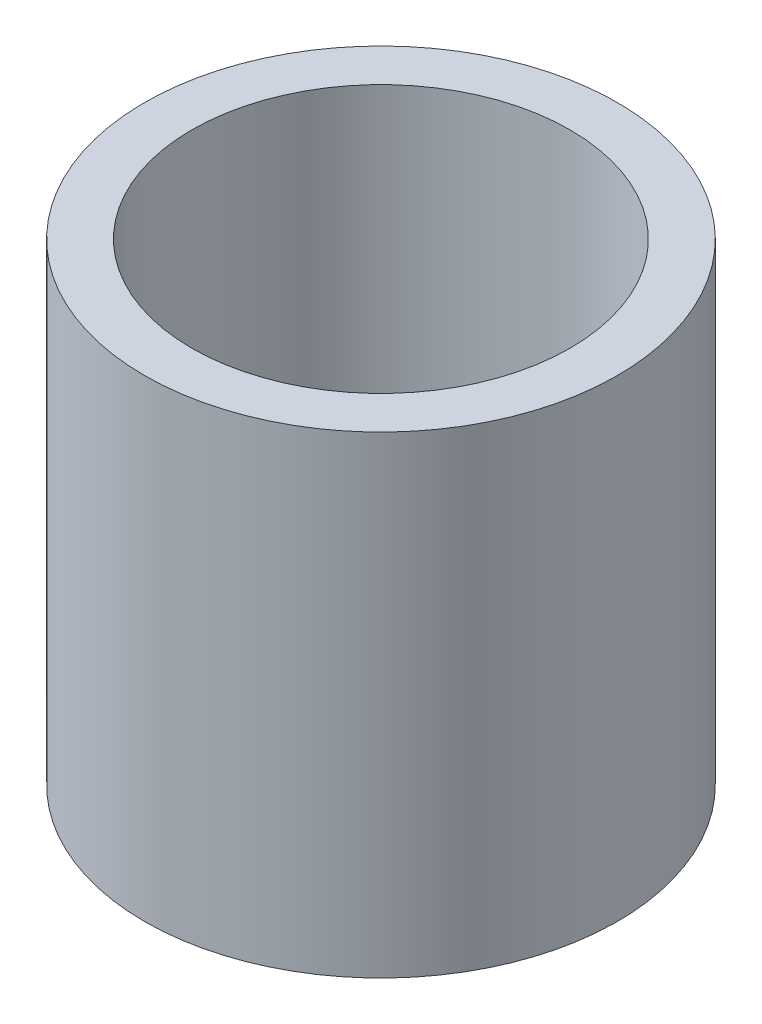
ISO-10303-21;
HEADER;
FILE_DESCRIPTION(('STEP AP214'),'2;1');
FILE_NAME('part.step','',(''),(''),'','','');
FILE_SCHEMA(('AUTOMOTIVE_DESIGN { 1 0 10303 214 1 1 1 1 }'));
ENDSEC;
DATA;
#1=APPLICATION_CONTEXT('core data for automotive mechanical design processes');
#2=APPLICATION_PROTOCOL_DEFINITION('international standard','automotive_design',2000,#1);
#3=PRODUCT_CONTEXT('',#1,'mechanical');
#4=PRODUCT('Part','Part','',(#3));
#5=PRODUCT_RELATED_PRODUCT_CATEGORY('part','',(#4));
#6=PRODUCT_DEFINITION_FORMATION('','',#4);
#7=PRODUCT_DEFINITION_CONTEXT('part definition',#1,'design');
#8=PRODUCT_DEFINITION('design','',#6,#7);
#9=PRODUCT_DEFINITION_SHAPE('','',#8);
#10=(LENGTH_UNIT() NAMED_UNIT(*) SI_UNIT(.MILLI.,.METRE.));
#11=(NAMED_UNIT(*) PLANE_ANGLE_UNIT() SI_UNIT($,.RADIAN.));
#12=(NAMED_UNIT(*) SI_UNIT($,.STERADIAN.) SOLID_ANGLE_UNIT());
#13=UNCERTAINTY_MEASURE_WITH_UNIT(LENGTH_MEASURE(1.E-05),#10,'distance_accuracy_value','');
#14=(GEOMETRIC_REPRESENTATION_CONTEXT(3) GLOBAL_UNCERTAINTY_ASSIGNED_CONTEXT((#13)) GLOBAL_UNIT_ASSIGNED_CONTEXT((#10,
#11,#12)) REPRESENTATION_CONTEXT('',''));
#15=CARTESIAN_POINT('',(0.,0.,0.));
#16=DIRECTION('',(0.,0.,1.));
#17=DIRECTION('',(1.,0.,0.));
#18=AXIS2_PLACEMENT_3D('',#15,#16,#17);
#19=CARTESIAN_POINT('',(0.,10.,0.));
#20=DIRECTION('',(0.,1.,0.));
#21=DIRECTION('',(0.,0.,1.));
#22=AXIS2_PLACEMENT_3D('',#19,#20,#21);
#23=PLANE('',#22);
#24=CARTESIAN_POINT('',(0.,10.,0.));
#25=DIRECTION('',(0.,1.,0.));
#26=DIRECTION('',(0.,0.,1.));
#27=AXIS2_PLACEMENT_3D('',#24,#25,#26);
#28=CIRCLE('',#27,5.);
#29=CARTESIAN_POINT('',(0.,10.,5.));
#30=VERTEX_POINT('',#29);
#31=EDGE_CURVE('E12',#30,#30,#28,.T.);
#32=ORIENTED_EDGE('',*,*,#31,.T.);
#33=EDGE_LOOP('',(#32));
#34=FACE_BOUND('',#33,.T.);
#35=CARTESIAN_POINT('',(0.,10.,0.));
#36=DIRECTION('',(0.,1.,0.));
#37=DIRECTION('',(0.,0.,1.));
#38=AXIS2_PLACEMENT_3D('',#35,#36,#37);
#39=CIRCLE('',#38,4.);
#40=CARTESIAN_POINT('',(0.,10.,4.));
#41=VERTEX_POINT('',#40);
#42=EDGE_CURVE('E51',#41,#41,#39,.T.);
#43=ORIENTED_EDGE('',*,*,#42,.F.);
#44=EDGE_LOOP('',(#43));
#45=FACE_BOUND('',#44,.T.);
#46=ADVANCED_FACE('F40',(#34,#45),#23,.T.);
#47=CARTESIAN_POINT('',(0.,0.,0.));
#48=DIRECTION('',(0.,1.,0.));
#49=DIRECTION('',(0.,0.,1.));
#50=AXIS2_PLACEMENT_3D('',#47,#48,#49);
#51=PLANE('',#50);
#52=CARTESIAN_POINT('',(0.,0.,0.));
#53=DIRECTION('',(0.,1.,0.));
#54=DIRECTION('',(0.,0.,1.));
#55=AXIS2_PLACEMENT_3D('',#52,#53,#54);
#56=CIRCLE('',#55,5.);
#57=CARTESIAN_POINT('',(0.,0.,5.));
#58=VERTEX_POINT('',#57);
#59=EDGE_CURVE('E44',#58,#58,#56,.T.);
#60=ORIENTED_EDGE('',*,*,#59,.F.);
#61=EDGE_LOOP('',(#60));
#62=FACE_BOUND('',#61,.T.);
#63=CARTESIAN_POINT('',(0.,0.,0.));
#64=DIRECTION('',(0.,1.,0.));
#65=DIRECTION('',(0.,0.,1.));
#66=AXIS2_PLACEMENT_3D('',#63,#64,#65);
#67=CIRCLE('',#66,4.);
#68=CARTESIAN_POINT('',(0.,0.,4.));
#69=VERTEX_POINT('',#68);
#70=EDGE_CURVE('E53',#69,#69,#67,.T.);
#71=ORIENTED_EDGE('',*,*,#70,.T.);
#72=EDGE_LOOP('',(#71));
#73=FACE_BOUND('',#72,.T.);
#74=ADVANCED_FACE('F63',(#62,#73),#51,.F.);
#75=CARTESIAN_POINT('',(0.,10.,0.));
#76=DIRECTION('',(0.,-1.,0.));
#77=DIRECTION('',(0.,0.,-1.));
#78=AXIS2_PLACEMENT_3D('',#75,#76,#77);
#79=CYLINDRICAL_SURFACE('',#78,5.);
#80=ORIENTED_EDGE('',*,*,#31,.F.);
#81=EDGE_LOOP('',(#80));
#82=FACE_BOUND('',#81,.T.);
#83=ORIENTED_EDGE('',*,*,#59,.T.);
#84=EDGE_LOOP('',(#83));
#85=FACE_BOUND('',#84,.T.);
#86=ADVANCED_FACE('F42',(#82,#85),#79,.T.);
#87=CARTESIAN_POINT('',(0.,10.,0.));
#88=DIRECTION('',(0.,-1.,0.));
#89=DIRECTION('',(0.,0.,-1.));
#90=AXIS2_PLACEMENT_3D('',#87,#88,#89);
#91=CYLINDRICAL_SURFACE('',#90,4.);
#92=ORIENTED_EDGE('',*,*,#42,.T.);
#93=EDGE_LOOP('',(#92));
#94=FACE_BOUND('',#93,.T.);
#95=ORIENTED_EDGE('',*,*,#70,.F.);
#96=EDGE_LOOP('',(#95));
#97=FACE_BOUND('',#96,.T.);
#98=ADVANCED_FACE('F59',(#94,#97),#91,.F.);
#99=CLOSED_SHELL('',(#46,#74,#86,#98));
#100=MANIFOLD_SOLID_BREP('B2',#99);
#101=ADVANCED_BREP_SHAPE_REPRESENTATION('',(#18,#100),#14);
#102=SHAPE_DEFINITION_REPRESENTATION(#9,#101);
ENDSEC;
END-ISO-10303-21;
